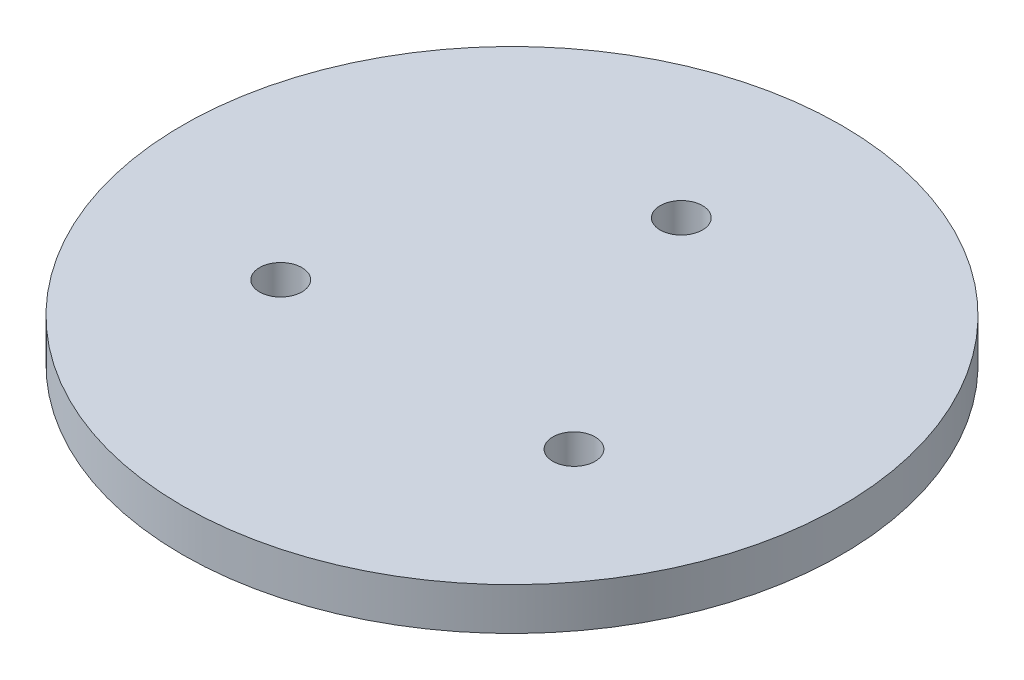
ISO-10303-21;
HEADER;
FILE_DESCRIPTION(('STEP AP214'),'2;1');
FILE_NAME('part.step','',(''),(''),'','','');
FILE_SCHEMA(('AUTOMOTIVE_DESIGN { 1 0 10303 214 1 1 1 1 }'));
ENDSEC;
DATA;
#1=APPLICATION_CONTEXT('core data for automotive mechanical design processes');
#2=APPLICATION_PROTOCOL_DEFINITION('international standard','automotive_design',2000,#1);
#3=PRODUCT_CONTEXT('',#1,'mechanical');
#4=PRODUCT('Part','Part','',(#3));
#5=PRODUCT_RELATED_PRODUCT_CATEGORY('part','',(#4));
#6=PRODUCT_DEFINITION_FORMATION('','',#4);
#7=PRODUCT_DEFINITION_CONTEXT('part definition',#1,'design');
#8=PRODUCT_DEFINITION('design','',#6,#7);
#9=PRODUCT_DEFINITION_SHAPE('','',#8);
#10=(LENGTH_UNIT() NAMED_UNIT(*) SI_UNIT(.MILLI.,.METRE.));
#11=(NAMED_UNIT(*) PLANE_ANGLE_UNIT() SI_UNIT($,.RADIAN.));
#12=(NAMED_UNIT(*) SI_UNIT($,.STERADIAN.) SOLID_ANGLE_UNIT());
#13=UNCERTAINTY_MEASURE_WITH_UNIT(LENGTH_MEASURE(1.E-05),#10,'distance_accuracy_value','');
#14=(GEOMETRIC_REPRESENTATION_CONTEXT(3) GLOBAL_UNCERTAINTY_ASSIGNED_CONTEXT((#13)) GLOBAL_UNIT_ASSIGNED_CONTEXT((#10,
#11,#12)) REPRESENTATION_CONTEXT('',''));
#15=CARTESIAN_POINT('',(0.,0.,0.));
#16=DIRECTION('',(0.,0.,1.));
#17=DIRECTION('',(1.,0.,0.));
#18=AXIS2_PLACEMENT_3D('',#15,#16,#17);
#19=CARTESIAN_POINT('',(0.,10.,0.));
#20=DIRECTION('',(0.,1.,0.));
#21=DIRECTION('',(0.,0.,1.));
#22=AXIS2_PLACEMENT_3D('',#19,#20,#21);
#23=PLANE('',#22);
#24=CARTESIAN_POINT('',(34.6410161513801,10.,19.9999999999985));
#25=DIRECTION('',(0.,1.,0.));
#26=DIRECTION('',(0.,0.,1.));
#27=AXIS2_PLACEMENT_3D('',#24,#25,#26);
#28=CIRCLE('',#27,5.0000000000022);
#29=CARTESIAN_POINT('',(34.6410161513801,10.,25.0000000000007));
#30=VERTEX_POINT('',#29);
#31=EDGE_CURVE('E46',#30,#30,#28,.T.);
#32=ORIENTED_EDGE('',*,*,#31,.F.);
#33=EDGE_LOOP('',(#32));
#34=FACE_BOUND('',#33,.T.);
#35=CARTESIAN_POINT('',(0.,10.,0.));
#36=DIRECTION('',(0.,1.,0.));
#37=DIRECTION('',(0.,0.,1.));
#38=AXIS2_PLACEMENT_3D('',#35,#36,#37);
#39=CIRCLE('',#38,77.8538565726202);
#40=CARTESIAN_POINT('',(0.,10.,77.8538565726202));
#41=VERTEX_POINT('',#40);
#42=EDGE_CURVE('E10',#41,#41,#39,.T.);
#43=ORIENTED_EDGE('',*,*,#42,.T.);
#44=EDGE_LOOP('',(#43));
#45=FACE_BOUND('',#44,.T.);
#46=CARTESIAN_POINT('',(0.,10.,-40.));
#47=DIRECTION('',(0.,1.,0.));
#48=DIRECTION('',(0.,0.,1.));
#49=AXIS2_PLACEMENT_3D('',#46,#47,#48);
#50=CIRCLE('',#49,5.);
#51=CARTESIAN_POINT('',(0.,10.,-35.));
#52=VERTEX_POINT('',#51);
#53=EDGE_CURVE('E41',#52,#52,#50,.T.);
#54=ORIENTED_EDGE('',*,*,#53,.F.);
#55=EDGE_LOOP('',(#54));
#56=FACE_BOUND('',#55,.T.);
#57=CARTESIAN_POINT('',(-34.641016151375,10.,20.0000000000015));
#58=DIRECTION('',(0.,1.,0.));
#59=DIRECTION('',(0.,0.,1.));
#60=AXIS2_PLACEMENT_3D('',#57,#58,#59);
#61=CIRCLE('',#60,5.00000000000323);
#62=CARTESIAN_POINT('',(-34.641016151375,10.,25.0000000000047));
#63=VERTEX_POINT('',#62);
#64=EDGE_CURVE('E52',#63,#63,#61,.T.);
#65=ORIENTED_EDGE('',*,*,#64,.F.);
#66=EDGE_LOOP('',(#65));
#67=FACE_BOUND('',#66,.T.);
#68=ADVANCED_FACE('F30',(#34,#45,#56,#67),#23,.T.);
#69=CARTESIAN_POINT('',(0.,0.,0.));
#70=DIRECTION('',(0.,1.,0.));
#71=DIRECTION('',(0.,0.,1.));
#72=AXIS2_PLACEMENT_3D('',#69,#70,#71);
#73=PLANE('',#72);
#74=CARTESIAN_POINT('',(0.,0.,0.));
#75=DIRECTION('',(0.,1.,0.));
#76=DIRECTION('',(0.,0.,1.));
#77=AXIS2_PLACEMENT_3D('',#74,#75,#76);
#78=CIRCLE('',#77,77.8538565726202);
#79=CARTESIAN_POINT('',(0.,0.,77.8538565726202));
#80=VERTEX_POINT('',#79);
#81=EDGE_CURVE('E34',#80,#80,#78,.T.);
#82=ORIENTED_EDGE('',*,*,#81,.F.);
#83=EDGE_LOOP('',(#82));
#84=FACE_BOUND('',#83,.T.);
#85=CARTESIAN_POINT('',(0.,0.,-40.));
#86=DIRECTION('',(0.,1.,0.));
#87=DIRECTION('',(0.,0.,1.));
#88=AXIS2_PLACEMENT_3D('',#85,#86,#87);
#89=CIRCLE('',#88,5.);
#90=CARTESIAN_POINT('',(0.,0.,-35.));
#91=VERTEX_POINT('',#90);
#92=EDGE_CURVE('E43',#91,#91,#89,.T.);
#93=ORIENTED_EDGE('',*,*,#92,.T.);
#94=EDGE_LOOP('',(#93));
#95=FACE_BOUND('',#94,.T.);
#96=CARTESIAN_POINT('',(34.6410161513801,0.,19.9999999999985));
#97=DIRECTION('',(0.,1.,0.));
#98=DIRECTION('',(0.,0.,1.));
#99=AXIS2_PLACEMENT_3D('',#96,#97,#98);
#100=CIRCLE('',#99,5.0000000000022);
#101=CARTESIAN_POINT('',(34.6410161513801,0.,25.0000000000007));
#102=VERTEX_POINT('',#101);
#103=EDGE_CURVE('E49',#102,#102,#100,.T.);
#104=ORIENTED_EDGE('',*,*,#103,.T.);
#105=EDGE_LOOP('',(#104));
#106=FACE_BOUND('',#105,.T.);
#107=CARTESIAN_POINT('',(-34.641016151375,0.,20.0000000000015));
#108=DIRECTION('',(0.,1.,0.));
#109=DIRECTION('',(0.,0.,1.));
#110=AXIS2_PLACEMENT_3D('',#107,#108,#109);
#111=CIRCLE('',#110,5.00000000000323);
#112=CARTESIAN_POINT('',(-34.641016151375,0.,25.0000000000047));
#113=VERTEX_POINT('',#112);
#114=EDGE_CURVE('E55',#113,#113,#111,.T.);
#115=ORIENTED_EDGE('',*,*,#114,.T.);
#116=EDGE_LOOP('',(#115));
#117=FACE_BOUND('',#116,.T.);
#118=ADVANCED_FACE('F65',(#84,#95,#106,#117),#73,.F.);
#119=CARTESIAN_POINT('',(0.,10.,0.));
#120=DIRECTION('',(0.,-1.,0.));
#121=DIRECTION('',(0.,0.,-1.));
#122=AXIS2_PLACEMENT_3D('',#119,#120,#121);
#123=CYLINDRICAL_SURFACE('',#122,77.8538565726202);
#124=ORIENTED_EDGE('',*,*,#42,.F.);
#125=EDGE_LOOP('',(#124));
#126=FACE_BOUND('',#125,.T.);
#127=ORIENTED_EDGE('',*,*,#81,.T.);
#128=EDGE_LOOP('',(#127));
#129=FACE_BOUND('',#128,.T.);
#130=ADVANCED_FACE('F32',(#126,#129),#123,.T.);
#131=CARTESIAN_POINT('',(0.,10.,-40.));
#132=DIRECTION('',(0.,-1.,0.));
#133=DIRECTION('',(0.,0.,-1.));
#134=AXIS2_PLACEMENT_3D('',#131,#132,#133);
#135=CYLINDRICAL_SURFACE('',#134,5.);
#136=ORIENTED_EDGE('',*,*,#53,.T.);
#137=EDGE_LOOP('',(#136));
#138=FACE_BOUND('',#137,.T.);
#139=ORIENTED_EDGE('',*,*,#92,.F.);
#140=EDGE_LOOP('',(#139));
#141=FACE_BOUND('',#140,.T.);
#142=ADVANCED_FACE('F74',(#138,#141),#135,.F.);
#143=CARTESIAN_POINT('',(34.6410161513801,10.,19.9999999999985));
#144=DIRECTION('',(0.,-1.,0.));
#145=DIRECTION('',(0.,0.,-1.));
#146=AXIS2_PLACEMENT_3D('',#143,#144,#145);
#147=CYLINDRICAL_SURFACE('',#146,5.0000000000022);
#148=ORIENTED_EDGE('',*,*,#31,.T.);
#149=EDGE_LOOP('',(#148));
#150=FACE_BOUND('',#149,.T.);
#151=ORIENTED_EDGE('',*,*,#103,.F.);
#152=EDGE_LOOP('',(#151));
#153=FACE_BOUND('',#152,.T.);
#154=ADVANCED_FACE('F77',(#150,#153),#147,.F.);
#155=CARTESIAN_POINT('',(-34.641016151375,10.,20.0000000000015));
#156=DIRECTION('',(0.,-1.,0.));
#157=DIRECTION('',(0.,0.,-1.));
#158=AXIS2_PLACEMENT_3D('',#155,#156,#157);
#159=CYLINDRICAL_SURFACE('',#158,5.00000000000323);
#160=ORIENTED_EDGE('',*,*,#64,.T.);
#161=EDGE_LOOP('',(#160));
#162=FACE_BOUND('',#161,.T.);
#163=ORIENTED_EDGE('',*,*,#114,.F.);
#164=EDGE_LOOP('',(#163));
#165=FACE_BOUND('',#164,.T.);
#166=ADVANCED_FACE('F61',(#162,#165),#159,.F.);
#167=CLOSED_SHELL('',(#68,#118,#130,#142,#154,#166));
#168=MANIFOLD_SOLID_BREP('B2',#167);
#169=ADVANCED_BREP_SHAPE_REPRESENTATION('',(#18,#168),#14);
#170=SHAPE_DEFINITION_REPRESENTATION(#9,#169);
ENDSEC;
END-ISO-10303-21;
